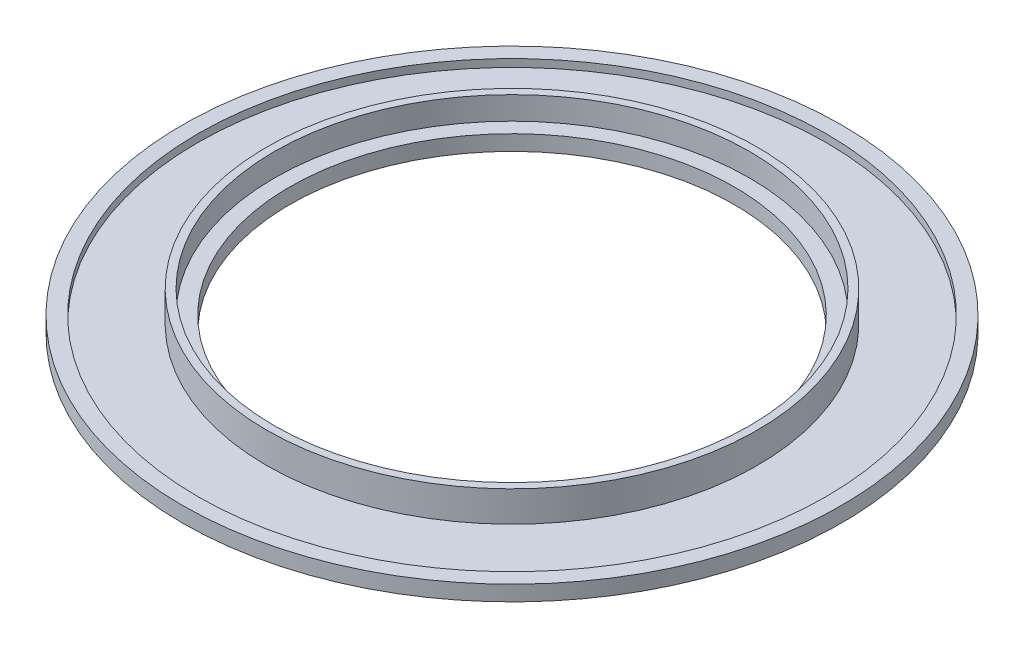
ISO-10303-21;
HEADER;
FILE_DESCRIPTION(('STEP AP214'),'2;1');
FILE_NAME('part.step','',(''),(''),'','','');
FILE_SCHEMA(('AUTOMOTIVE_DESIGN { 1 0 10303 214 1 1 1 1 }'));
ENDSEC;
DATA;
#1=APPLICATION_CONTEXT('core data for automotive mechanical design processes');
#2=APPLICATION_PROTOCOL_DEFINITION('international standard','automotive_design',2000,#1);
#3=PRODUCT_CONTEXT('',#1,'mechanical');
#4=PRODUCT('Part','Part','',(#3));
#5=PRODUCT_RELATED_PRODUCT_CATEGORY('part','',(#4));
#6=PRODUCT_DEFINITION_FORMATION('','',#4);
#7=PRODUCT_DEFINITION_CONTEXT('part definition',#1,'design');
#8=PRODUCT_DEFINITION('design','',#6,#7);
#9=PRODUCT_DEFINITION_SHAPE('','',#8);
#10=(LENGTH_UNIT() NAMED_UNIT(*) SI_UNIT(.MILLI.,.METRE.));
#11=(NAMED_UNIT(*) PLANE_ANGLE_UNIT() SI_UNIT($,.RADIAN.));
#12=(NAMED_UNIT(*) SI_UNIT($,.STERADIAN.) SOLID_ANGLE_UNIT());
#13=UNCERTAINTY_MEASURE_WITH_UNIT(LENGTH_MEASURE(1.E-05),#10,'distance_accuracy_value','');
#14=(GEOMETRIC_REPRESENTATION_CONTEXT(3) GLOBAL_UNCERTAINTY_ASSIGNED_CONTEXT((#13)) GLOBAL_UNIT_ASSIGNED_CONTEXT((#10,
#11,#12)) REPRESENTATION_CONTEXT('',''));
#15=CARTESIAN_POINT('',(0.,0.,0.));
#16=DIRECTION('',(0.,0.,1.));
#17=DIRECTION('',(1.,0.,0.));
#18=AXIS2_PLACEMENT_3D('',#15,#16,#17);
#19=CARTESIAN_POINT('',(0.,2.,0.));
#20=DIRECTION('',(0.,-1.,0.));
#21=DIRECTION('',(0.,0.,-1.));
#22=AXIS2_PLACEMENT_3D('',#19,#20,#21);
#23=CYLINDRICAL_SURFACE('',#22,43.);
#24=CARTESIAN_POINT('',(0.,2.,0.));
#25=DIRECTION('',(0.,1.,0.));
#26=DIRECTION('',(0.,0.,1.));
#27=AXIS2_PLACEMENT_3D('',#24,#25,#26);
#28=CIRCLE('',#27,43.);
#29=CARTESIAN_POINT('',(0.,2.,43.));
#30=VERTEX_POINT('',#29);
#31=EDGE_CURVE('E10',#30,#30,#28,.T.);
#32=ORIENTED_EDGE('',*,*,#31,.F.);
#33=EDGE_LOOP('',(#32));
#34=FACE_BOUND('',#33,.T.);
#35=CARTESIAN_POINT('',(0.,0.,0.));
#36=DIRECTION('',(0.,1.,0.));
#37=DIRECTION('',(0.,0.,1.));
#38=AXIS2_PLACEMENT_3D('',#35,#36,#37);
#39=CIRCLE('',#38,43.);
#40=CARTESIAN_POINT('',(0.,0.,43.));
#41=VERTEX_POINT('',#40);
#42=EDGE_CURVE('E42',#41,#41,#39,.T.);
#43=ORIENTED_EDGE('',*,*,#42,.T.);
#44=EDGE_LOOP('',(#43));
#45=FACE_BOUND('',#44,.T.);
#46=ADVANCED_FACE('F39',(#34,#45),#23,.T.);
#47=CARTESIAN_POINT('',(0.,2.,0.));
#48=DIRECTION('',(0.,1.,0.));
#49=DIRECTION('',(0.,0.,1.));
#50=AXIS2_PLACEMENT_3D('',#47,#48,#49);
#51=PLANE('',#50);
#52=CARTESIAN_POINT('',(0.,2.,0.));
#53=DIRECTION('',(0.,1.,0.));
#54=DIRECTION('',(0.,0.,1.));
#55=AXIS2_PLACEMENT_3D('',#52,#53,#54);
#56=CIRCLE('',#55,41.);
#57=CARTESIAN_POINT('',(0.,2.,41.));
#58=VERTEX_POINT('',#57);
#59=EDGE_CURVE('E51',#58,#58,#56,.T.);
#60=ORIENTED_EDGE('',*,*,#59,.F.);
#61=EDGE_LOOP('',(#60));
#62=FACE_BOUND('',#61,.T.);
#63=ORIENTED_EDGE('',*,*,#31,.T.);
#64=EDGE_LOOP('',(#63));
#65=FACE_BOUND('',#64,.T.);
#66=ADVANCED_FACE('F132',(#62,#65),#51,.T.);
#67=CARTESIAN_POINT('',(0.,0.,0.));
#68=DIRECTION('',(0.,1.,0.));
#69=DIRECTION('',(0.,0.,1.));
#70=AXIS2_PLACEMENT_3D('',#67,#68,#69);
#71=PLANE('',#70);
#72=CARTESIAN_POINT('',(0.,0.,0.));
#73=DIRECTION('',(0.,1.,0.));
#74=DIRECTION('',(0.,0.,1.));
#75=AXIS2_PLACEMENT_3D('',#72,#73,#74);
#76=CIRCLE('',#75,29.);
#77=CARTESIAN_POINT('',(0.,0.,29.));
#78=VERTEX_POINT('',#77);
#79=EDGE_CURVE('E73',#78,#78,#76,.T.);
#80=ORIENTED_EDGE('',*,*,#79,.T.);
#81=EDGE_LOOP('',(#80));
#82=FACE_BOUND('',#81,.T.);
#83=ORIENTED_EDGE('',*,*,#42,.F.);
#84=EDGE_LOOP('',(#83));
#85=FACE_BOUND('',#84,.T.);
#86=ADVANCED_FACE('F85',(#82,#85),#71,.F.);
#87=CARTESIAN_POINT('',(0.,1.,0.));
#88=DIRECTION('',(0.,1.,0.));
#89=DIRECTION('',(0.,0.,1.));
#90=AXIS2_PLACEMENT_3D('',#87,#88,#89);
#91=PLANE('',#90);
#92=CARTESIAN_POINT('',(0.,1.,0.));
#93=DIRECTION('',(0.,1.,0.));
#94=DIRECTION('',(0.,0.,1.));
#95=AXIS2_PLACEMENT_3D('',#92,#93,#94);
#96=CIRCLE('',#95,32.);
#97=CARTESIAN_POINT('',(0.,1.,32.));
#98=VERTEX_POINT('',#97);
#99=EDGE_CURVE('E61',#98,#98,#96,.T.);
#100=ORIENTED_EDGE('',*,*,#99,.F.);
#101=EDGE_LOOP('',(#100));
#102=FACE_BOUND('',#101,.T.);
#103=CARTESIAN_POINT('',(0.,1.,0.));
#104=DIRECTION('',(0.,1.,0.));
#105=DIRECTION('',(0.,0.,1.));
#106=AXIS2_PLACEMENT_3D('',#103,#104,#105);
#107=CIRCLE('',#106,41.);
#108=CARTESIAN_POINT('',(0.,1.,41.));
#109=VERTEX_POINT('',#108);
#110=EDGE_CURVE('E56',#109,#109,#107,.T.);
#111=ORIENTED_EDGE('',*,*,#110,.T.);
#112=EDGE_LOOP('',(#111));
#113=FACE_BOUND('',#112,.T.);
#114=ADVANCED_FACE('F119',(#102,#113),#91,.T.);
#115=CARTESIAN_POINT('',(0.,1.,0.));
#116=DIRECTION('',(0.,1.,0.));
#117=DIRECTION('',(0.,0.,1.));
#118=AXIS2_PLACEMENT_3D('',#115,#116,#117);
#119=CYLINDRICAL_SURFACE('',#118,41.);
#120=ORIENTED_EDGE('',*,*,#59,.T.);
#121=EDGE_LOOP('',(#120));
#122=FACE_BOUND('',#121,.T.);
#123=ORIENTED_EDGE('',*,*,#110,.F.);
#124=EDGE_LOOP('',(#123));
#125=FACE_BOUND('',#124,.T.);
#126=ADVANCED_FACE('F110',(#122,#125),#119,.F.);
#127=CARTESIAN_POINT('',(0.,5.,0.));
#128=DIRECTION('',(0.,1.,0.));
#129=DIRECTION('',(0.,0.,1.));
#130=AXIS2_PLACEMENT_3D('',#127,#128,#129);
#131=PLANE('',#130);
#132=CARTESIAN_POINT('',(0.,5.,0.));
#133=DIRECTION('',(0.,1.,0.));
#134=DIRECTION('',(0.,0.,1.));
#135=AXIS2_PLACEMENT_3D('',#132,#133,#134);
#136=CIRCLE('',#135,31.);
#137=CARTESIAN_POINT('',(0.,5.,31.));
#138=VERTEX_POINT('',#137);
#139=EDGE_CURVE('E69',#138,#138,#136,.T.);
#140=ORIENTED_EDGE('',*,*,#139,.F.);
#141=EDGE_LOOP('',(#140));
#142=FACE_BOUND('',#141,.T.);
#143=CARTESIAN_POINT('',(0.,5.,0.));
#144=DIRECTION('',(0.,1.,0.));
#145=DIRECTION('',(0.,0.,1.));
#146=AXIS2_PLACEMENT_3D('',#143,#144,#145);
#147=CIRCLE('',#146,32.);
#148=CARTESIAN_POINT('',(0.,5.,32.));
#149=VERTEX_POINT('',#148);
#150=EDGE_CURVE('E60',#149,#149,#147,.T.);
#151=ORIENTED_EDGE('',*,*,#150,.T.);
#152=EDGE_LOOP('',(#151));
#153=FACE_BOUND('',#152,.T.);
#154=ADVANCED_FACE('F107',(#142,#153),#131,.T.);
#155=CARTESIAN_POINT('',(0.,5.,0.));
#156=DIRECTION('',(0.,-1.,0.));
#157=DIRECTION('',(0.,0.,-1.));
#158=AXIS2_PLACEMENT_3D('',#155,#156,#157);
#159=CYLINDRICAL_SURFACE('',#158,32.);
#160=ORIENTED_EDGE('',*,*,#150,.F.);
#161=EDGE_LOOP('',(#160));
#162=FACE_BOUND('',#161,.T.);
#163=ORIENTED_EDGE('',*,*,#99,.T.);
#164=EDGE_LOOP('',(#163));
#165=FACE_BOUND('',#164,.T.);
#166=ADVANCED_FACE('F103',(#162,#165),#159,.T.);
#167=CARTESIAN_POINT('',(0.,2.,0.));
#168=DIRECTION('',(0.,1.,0.));
#169=DIRECTION('',(0.,0.,1.));
#170=AXIS2_PLACEMENT_3D('',#167,#168,#169);
#171=CYLINDRICAL_SURFACE('',#170,31.);
#172=CARTESIAN_POINT('',(0.,2.,0.));
#173=DIRECTION('',(0.,1.,0.));
#174=DIRECTION('',(0.,0.,1.));
#175=AXIS2_PLACEMENT_3D('',#172,#173,#174);
#176=CIRCLE('',#175,31.);
#177=CARTESIAN_POINT('',(0.,2.,31.));
#178=VERTEX_POINT('',#177);
#179=EDGE_CURVE('E65',#178,#178,#176,.T.);
#180=ORIENTED_EDGE('',*,*,#179,.F.);
#181=EDGE_LOOP('',(#180));
#182=FACE_BOUND('',#181,.T.);
#183=ORIENTED_EDGE('',*,*,#139,.T.);
#184=EDGE_LOOP('',(#183));
#185=FACE_BOUND('',#184,.T.);
#186=ADVANCED_FACE('F97',(#182,#185),#171,.F.);
#187=CARTESIAN_POINT('',(0.,2.,0.));
#188=DIRECTION('',(0.,1.,0.));
#189=DIRECTION('',(0.,0.,1.));
#190=AXIS2_PLACEMENT_3D('',#187,#188,#189);
#191=PLANE('',#190);
#192=CARTESIAN_POINT('',(0.,2.,0.));
#193=DIRECTION('',(0.,1.,0.));
#194=DIRECTION('',(0.,0.,1.));
#195=AXIS2_PLACEMENT_3D('',#192,#193,#194);
#196=CIRCLE('',#195,29.);
#197=CARTESIAN_POINT('',(0.,2.,29.));
#198=VERTEX_POINT('',#197);
#199=EDGE_CURVE('E77',#198,#198,#196,.T.);
#200=ORIENTED_EDGE('',*,*,#199,.F.);
#201=EDGE_LOOP('',(#200));
#202=FACE_BOUND('',#201,.T.);
#203=ORIENTED_EDGE('',*,*,#179,.T.);
#204=EDGE_LOOP('',(#203));
#205=FACE_BOUND('',#204,.T.);
#206=ADVANCED_FACE('F91',(#202,#205),#191,.T.);
#207=CARTESIAN_POINT('',(0.,0.,0.));
#208=DIRECTION('',(0.,1.,0.));
#209=DIRECTION('',(0.,0.,1.));
#210=AXIS2_PLACEMENT_3D('',#207,#208,#209);
#211=CYLINDRICAL_SURFACE('',#210,29.);
#212=ORIENTED_EDGE('',*,*,#79,.F.);
#213=EDGE_LOOP('',(#212));
#214=FACE_BOUND('',#213,.T.);
#215=ORIENTED_EDGE('',*,*,#199,.T.);
#216=EDGE_LOOP('',(#215));
#217=FACE_BOUND('',#216,.T.);
#218=ADVANCED_FACE('F88',(#214,#217),#211,.F.);
#219=CLOSED_SHELL('',(#46,#66,#86,#114,#126,#154,#166,#186,#206,#218));
#220=MANIFOLD_SOLID_BREP('B2',#219);
#221=ADVANCED_BREP_SHAPE_REPRESENTATION('',(#18,#220),#14);
#222=SHAPE_DEFINITION_REPRESENTATION(#9,#221);
ENDSEC;
END-ISO-10303-21;
